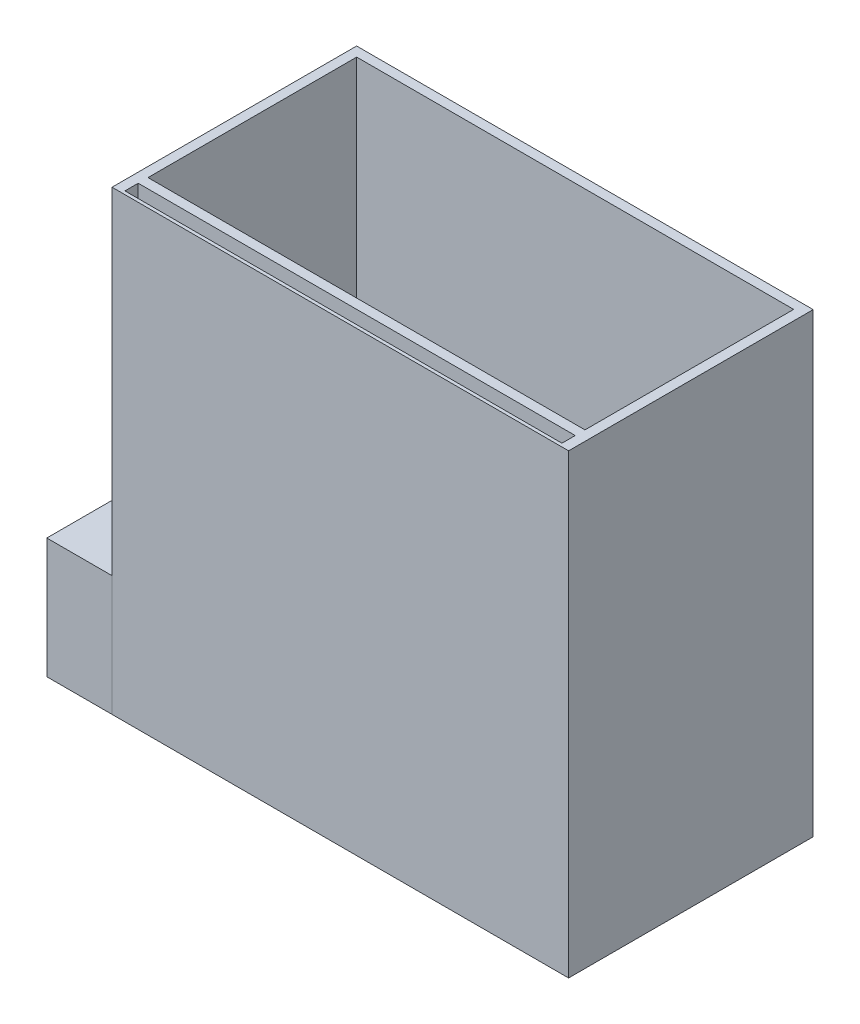
ISO-10303-21;
HEADER;
FILE_DESCRIPTION(('STEP AP214'),'2;1');
FILE_NAME('part.step','',(''),(''),'','','');
FILE_SCHEMA(('AUTOMOTIVE_DESIGN { 1 0 10303 214 1 1 1 1 }'));
ENDSEC;
DATA;
#1=APPLICATION_CONTEXT('core data for automotive mechanical design processes');
#2=APPLICATION_PROTOCOL_DEFINITION('international standard','automotive_design',2000,#1);
#3=PRODUCT_CONTEXT('',#1,'mechanical');
#4=PRODUCT('Part','Part','',(#3));
#5=PRODUCT_RELATED_PRODUCT_CATEGORY('part','',(#4));
#6=PRODUCT_DEFINITION_FORMATION('','',#4);
#7=PRODUCT_DEFINITION_CONTEXT('part definition',#1,'design');
#8=PRODUCT_DEFINITION('design','',#6,#7);
#9=PRODUCT_DEFINITION_SHAPE('','',#8);
#10=(LENGTH_UNIT() NAMED_UNIT(*) SI_UNIT(.MILLI.,.METRE.));
#11=(NAMED_UNIT(*) PLANE_ANGLE_UNIT() SI_UNIT($,.RADIAN.));
#12=(NAMED_UNIT(*) SI_UNIT($,.STERADIAN.) SOLID_ANGLE_UNIT());
#13=UNCERTAINTY_MEASURE_WITH_UNIT(LENGTH_MEASURE(1.E-05),#10,'distance_accuracy_value','');
#14=(GEOMETRIC_REPRESENTATION_CONTEXT(3) GLOBAL_UNCERTAINTY_ASSIGNED_CONTEXT((#13)) GLOBAL_UNIT_ASSIGNED_CONTEXT((#10,
#11,#12)) REPRESENTATION_CONTEXT('',''));
#15=CARTESIAN_POINT('',(0.,0.,0.));
#16=DIRECTION('',(0.,0.,1.));
#17=DIRECTION('',(1.,0.,0.));
#18=AXIS2_PLACEMENT_3D('',#15,#16,#17);
#19=CARTESIAN_POINT('',(-116.88679245283,140.,0.));
#20=DIRECTION('',(1.,0.,0.));
#21=DIRECTION('',(0.,0.,-1.));
#22=AXIS2_PLACEMENT_3D('',#19,#20,#21);
#23=PLANE('',#22);
#24=DIRECTION('',(0.,0.,-1.));
#25=VECTOR('',#24,1.);
#26=CARTESIAN_POINT('',(-116.88679245283,36.8464734911669,-58.003144654088));
#27=LINE('',#26,#25);
#28=CARTESIAN_POINT('',(-116.88679245283,36.8464734911669,16.996855345912));
#29=VERTEX_POINT('',#28);
#30=CARTESIAN_POINT('',(-116.88679245283,36.8464734911669,-58.003144654088));
#31=VERTEX_POINT('',#30);
#32=EDGE_CURVE('E11',#29,#31,#27,.T.);
#33=ORIENTED_EDGE('',*,*,#32,.F.);
#34=DIRECTION('',(0.,-1.,0.));
#35=VECTOR('',#34,1.);
#36=CARTESIAN_POINT('',(-116.88679245283,140.,16.996855345912));
#37=LINE('',#36,#35);
#38=CARTESIAN_POINT('',(-116.88679245283,140.,16.996855345912));
#39=VERTEX_POINT('',#38);
#40=EDGE_CURVE('E239',#39,#29,#37,.T.);
#41=ORIENTED_EDGE('',*,*,#40,.F.);
#42=DIRECTION('',(0.,0.,1.));
#43=VECTOR('',#42,1.);
#44=CARTESIAN_POINT('',(-116.88679245283,140.,0.));
#45=LINE('',#44,#43);
#46=CARTESIAN_POINT('',(-116.88679245283,140.,-58.003144654088));
#47=VERTEX_POINT('',#46);
#48=EDGE_CURVE('E373',#47,#39,#45,.T.);
#49=ORIENTED_EDGE('',*,*,#48,.F.);
#50=DIRECTION('',(0.,-1.,0.));
#51=VECTOR('',#50,1.);
#52=CARTESIAN_POINT('',(-116.88679245283,140.,-58.003144654088));
#53=LINE('',#52,#51);
#54=EDGE_CURVE('E375',#47,#31,#53,.T.);
#55=ORIENTED_EDGE('',*,*,#54,.T.);
#56=EDGE_LOOP('',(#33,#41,#49,#55));
#57=FACE_BOUND('',#56,.T.);
#58=ADVANCED_FACE('F41',(#57),#23,.F.);
#59=CARTESIAN_POINT('',(23.1132075471698,140.,0.));
#60=DIRECTION('',(1.,0.,0.));
#61=DIRECTION('',(0.,0.,-1.));
#62=AXIS2_PLACEMENT_3D('',#59,#60,#61);
#63=PLANE('',#62);
#64=DIRECTION('',(0.,0.,1.));
#65=VECTOR('',#64,1.);
#66=CARTESIAN_POINT('',(23.1132075471698,0.,0.));
#67=LINE('',#66,#65);
#68=CARTESIAN_POINT('',(23.1132075471698,0.,-58.003144654088));
#69=VERTEX_POINT('',#68);
#70=CARTESIAN_POINT('',(23.1132075471698,0.,16.996855345912));
#71=VERTEX_POINT('',#70);
#72=EDGE_CURVE('E360',#69,#71,#67,.T.);
#73=ORIENTED_EDGE('',*,*,#72,.F.);
#74=DIRECTION('',(0.,-1.,0.));
#75=VECTOR('',#74,1.);
#76=CARTESIAN_POINT('',(23.1132075471698,140.,-58.003144654088));
#77=LINE('',#76,#75);
#78=CARTESIAN_POINT('',(23.1132075471698,140.,-58.003144654088));
#79=VERTEX_POINT('',#78);
#80=EDGE_CURVE('E45',#79,#69,#77,.T.);
#81=ORIENTED_EDGE('',*,*,#80,.F.);
#82=DIRECTION('',(0.,0.,1.));
#83=VECTOR('',#82,1.);
#84=CARTESIAN_POINT('',(23.1132075471698,140.,0.));
#85=LINE('',#84,#83);
#86=CARTESIAN_POINT('',(23.1132075471698,140.,16.996855345912));
#87=VERTEX_POINT('',#86);
#88=EDGE_CURVE('E367',#79,#87,#85,.T.);
#89=ORIENTED_EDGE('',*,*,#88,.T.);
#90=DIRECTION('',(0.,1.,0.));
#91=VECTOR('',#90,1.);
#92=CARTESIAN_POINT('',(23.1132075471698,140.,16.996855345912));
#93=LINE('',#92,#91);
#94=EDGE_CURVE('E244',#71,#87,#93,.T.);
#95=ORIENTED_EDGE('',*,*,#94,.F.);
#96=EDGE_LOOP('',(#73,#81,#89,#95));
#97=FACE_BOUND('',#96,.T.);
#98=ADVANCED_FACE('F43',(#97),#63,.T.);
#99=CARTESIAN_POINT('',(0.,140.,-58.003144654088));
#100=DIRECTION('',(0.,0.,-1.));
#101=DIRECTION('',(-1.,0.,0.));
#102=AXIS2_PLACEMENT_3D('',#99,#100,#101);
#103=PLANE('',#102);
#104=DIRECTION('',(0.,-1.,0.));
#105=VECTOR('',#104,1.);
#106=CARTESIAN_POINT('',(-116.88679245283,27.2464734911669,-58.003144654088));
#107=LINE('',#106,#105);
#108=CARTESIAN_POINT('',(-116.88679245283,27.2464734911669,-58.003144654088));
#109=VERTEX_POINT('',#108);
#110=CARTESIAN_POINT('',(-116.88679245283,14.2464734911669,-58.003144654088));
#111=VERTEX_POINT('',#110);
#112=EDGE_CURVE('E276',#109,#111,#107,.T.);
#113=ORIENTED_EDGE('',*,*,#112,.F.);
#114=DIRECTION('',(1.,0.,0.));
#115=VECTOR('',#114,1.);
#116=CARTESIAN_POINT('',(-116.88679245283,27.2464734911669,-58.003144654088));
#117=LINE('',#116,#115);
#118=CARTESIAN_POINT('',(-122.63679245283,27.2464734911669,-58.003144654088));
#119=VERTEX_POINT('',#118);
#120=EDGE_CURVE('E287',#119,#109,#117,.T.);
#121=ORIENTED_EDGE('',*,*,#120,.F.);
#122=DIRECTION('',(0.,1.,0.));
#123=VECTOR('',#122,1.);
#124=CARTESIAN_POINT('',(-122.63679245283,27.2464734911669,-58.003144654088));
#125=LINE('',#124,#123);
#126=CARTESIAN_POINT('',(-122.63679245283,14.2464734911669,-58.003144654088));
#127=VERTEX_POINT('',#126);
#128=EDGE_CURVE('E298',#127,#119,#125,.T.);
#129=ORIENTED_EDGE('',*,*,#128,.F.);
#130=DIRECTION('',(-1.,0.,0.));
#131=VECTOR('',#130,1.);
#132=CARTESIAN_POINT('',(-116.88679245283,14.2464734911669,-58.003144654088));
#133=LINE('',#132,#131);
#134=EDGE_CURVE('E295',#111,#127,#133,.T.);
#135=ORIENTED_EDGE('',*,*,#134,.F.);
#136=EDGE_LOOP('',(#113,#121,#129,#135));
#137=FACE_BOUND('',#136,.T.);
#138=DIRECTION('',(1.,0.,0.));
#139=VECTOR('',#138,1.);
#140=CARTESIAN_POINT('',(0.,0.,-58.003144654088));
#141=LINE('',#140,#139);
#142=CARTESIAN_POINT('',(-136.88679245283,0.,-58.003144654088));
#143=VERTEX_POINT('',#142);
#144=EDGE_CURVE('E370',#143,#69,#141,.T.);
#145=ORIENTED_EDGE('',*,*,#144,.F.);
#146=DIRECTION('',(0.,-1.,0.));
#147=VECTOR('',#146,1.);
#148=CARTESIAN_POINT('',(-136.88679245283,36.8464734911669,-58.003144654088));
#149=LINE('',#148,#147);
#150=CARTESIAN_POINT('',(-136.88679245283,36.8464734911669,-58.003144654088));
#151=VERTEX_POINT('',#150);
#152=EDGE_CURVE('E312',#151,#143,#149,.T.);
#153=ORIENTED_EDGE('',*,*,#152,.F.);
#154=DIRECTION('',(1.,0.,0.));
#155=VECTOR('',#154,1.);
#156=CARTESIAN_POINT('',(-136.88679245283,36.8464734911669,-58.003144654088));
#157=LINE('',#156,#155);
#158=EDGE_CURVE('E321',#151,#31,#157,.T.);
#159=ORIENTED_EDGE('',*,*,#158,.T.);
#160=ORIENTED_EDGE('',*,*,#54,.F.);
#161=DIRECTION('',(1.,0.,0.));
#162=VECTOR('',#161,1.);
#163=CARTESIAN_POINT('',(0.,140.,-58.003144654088));
#164=LINE('',#163,#162);
#165=EDGE_CURVE('E369',#47,#79,#164,.T.);
#166=ORIENTED_EDGE('',*,*,#165,.T.);
#167=ORIENTED_EDGE('',*,*,#80,.T.);
#168=EDGE_LOOP('',(#145,#153,#159,#160,#166,#167));
#169=FACE_BOUND('',#168,.T.);
#170=ADVANCED_FACE('F381',(#137,#169),#103,.T.);
#171=CARTESIAN_POINT('',(0.,140.,0.));
#172=DIRECTION('',(0.,1.,0.));
#173=DIRECTION('',(0.,0.,1.));
#174=AXIS2_PLACEMENT_3D('',#171,#172,#173);
#175=PLANE('',#174);
#176=DIRECTION('',(0.,0.,1.));
#177=VECTOR('',#176,1.);
#178=CARTESIAN_POINT('',(-113.932929256957,140.,11.9276912054125));
#179=LINE('',#178,#177);
#180=CARTESIAN_POINT('',(-113.932929256957,140.,11.9276912054125));
#181=VERTEX_POINT('',#180);
#182=CARTESIAN_POINT('',(-113.932929256957,140.,15.9999896043341));
#183=VERTEX_POINT('',#182);
#184=EDGE_CURVE('E58',#181,#183,#179,.T.);
#185=ORIENTED_EDGE('',*,*,#184,.F.);
#186=DIRECTION('',(-1.,0.,0.));
#187=VECTOR('',#186,1.);
#188=CARTESIAN_POINT('',(20.0670707430429,140.,11.9276912054125));
#189=LINE('',#188,#187);
#190=CARTESIAN_POINT('',(20.0670707430429,140.,11.9276912054125));
#191=VERTEX_POINT('',#190);
#192=EDGE_CURVE('E220',#191,#181,#189,.T.);
#193=ORIENTED_EDGE('',*,*,#192,.F.);
#194=DIRECTION('',(0.,0.,-1.));
#195=VECTOR('',#194,1.);
#196=CARTESIAN_POINT('',(20.0670707430429,140.,11.9276912054125));
#197=LINE('',#196,#195);
#198=CARTESIAN_POINT('',(20.0670707430429,140.,15.9999896043341));
#199=VERTEX_POINT('',#198);
#200=EDGE_CURVE('E223',#199,#191,#197,.T.);
#201=ORIENTED_EDGE('',*,*,#200,.F.);
#202=DIRECTION('',(1.,0.,0.));
#203=VECTOR('',#202,1.);
#204=CARTESIAN_POINT('',(20.0670707430429,140.,15.9999896043341));
#205=LINE('',#204,#203);
#206=EDGE_CURVE('E229',#183,#199,#205,.T.);
#207=ORIENTED_EDGE('',*,*,#206,.F.);
#208=EDGE_LOOP('',(#185,#193,#201,#207));
#209=FACE_BOUND('',#208,.T.);
#210=DIRECTION('',(0.,0.,1.));
#211=VECTOR('',#210,1.);
#212=CARTESIAN_POINT('',(-113.932929256957,140.,-55.0700748409646));
#213=LINE('',#212,#211);
#214=CARTESIAN_POINT('',(-113.932929256957,140.,-55.0700748409646));
#215=VERTEX_POINT('',#214);
#216=CARTESIAN_POINT('',(-113.932929256957,140.,8.92992515903544));
#217=VERTEX_POINT('',#216);
#218=EDGE_CURVE('E334',#215,#217,#213,.T.);
#219=ORIENTED_EDGE('',*,*,#218,.F.);
#220=DIRECTION('',(-1.,0.,0.));
#221=VECTOR('',#220,1.);
#222=CARTESIAN_POINT('',(-113.932929256957,140.,-55.0700748409646));
#223=LINE('',#222,#221);
#224=CARTESIAN_POINT('',(20.0670707430429,140.,-55.0700748409646));
#225=VERTEX_POINT('',#224);
#226=EDGE_CURVE('E339',#225,#215,#223,.T.);
#227=ORIENTED_EDGE('',*,*,#226,.F.);
#228=DIRECTION('',(0.,0.,-1.));
#229=VECTOR('',#228,1.);
#230=CARTESIAN_POINT('',(20.0670707430429,140.,-55.0700748409646));
#231=LINE('',#230,#229);
#232=CARTESIAN_POINT('',(20.0670707430429,140.,8.92992515903544));
#233=VERTEX_POINT('',#232);
#234=EDGE_CURVE('E353',#233,#225,#231,.T.);
#235=ORIENTED_EDGE('',*,*,#234,.F.);
#236=DIRECTION('',(1.,0.,0.));
#237=VECTOR('',#236,1.);
#238=CARTESIAN_POINT('',(-113.932929256957,140.,8.92992515903544));
#239=LINE('',#238,#237);
#240=EDGE_CURVE('E350',#217,#233,#239,.T.);
#241=ORIENTED_EDGE('',*,*,#240,.F.);
#242=EDGE_LOOP('',(#219,#227,#235,#241));
#243=FACE_BOUND('',#242,.T.);
#244=ORIENTED_EDGE('',*,*,#88,.F.);
#245=ORIENTED_EDGE('',*,*,#165,.F.);
#246=ORIENTED_EDGE('',*,*,#48,.T.);
#247=DIRECTION('',(-1.,0.,0.));
#248=VECTOR('',#247,1.);
#249=CARTESIAN_POINT('',(-116.88679245283,140.,16.996855345912));
#250=LINE('',#249,#248);
#251=EDGE_CURVE('E247',#87,#39,#250,.T.);
#252=ORIENTED_EDGE('',*,*,#251,.F.);
#253=EDGE_LOOP('',(#244,#245,#246,#252));
#254=FACE_BOUND('',#253,.T.);
#255=ADVANCED_FACE('F429',(#209,#243,#254),#175,.T.);
#256=CARTESIAN_POINT('',(0.,0.,0.));
#257=DIRECTION('',(0.,1.,0.));
#258=DIRECTION('',(0.,0.,1.));
#259=AXIS2_PLACEMENT_3D('',#256,#257,#258);
#260=PLANE('',#259);
#261=ORIENTED_EDGE('',*,*,#72,.T.);
#262=DIRECTION('',(1.,0.,0.));
#263=VECTOR('',#262,1.);
#264=CARTESIAN_POINT('',(-116.88679245283,0.,16.996855345912));
#265=LINE('',#264,#263);
#266=CARTESIAN_POINT('',(-116.88679245283,0.,16.996855345912));
#267=VERTEX_POINT('',#266);
#268=EDGE_CURVE('E241',#267,#71,#265,.T.);
#269=ORIENTED_EDGE('',*,*,#268,.F.);
#270=DIRECTION('',(0.,0.,1.));
#271=VECTOR('',#270,1.);
#272=CARTESIAN_POINT('',(-116.88679245283,0.,-58.003144654088));
#273=LINE('',#272,#271);
#274=CARTESIAN_POINT('',(-116.88679245283,0.,16.9971158488808));
#275=VERTEX_POINT('',#274);
#276=EDGE_CURVE('E305',#267,#275,#273,.T.);
#277=ORIENTED_EDGE('',*,*,#276,.T.);
#278=DIRECTION('',(1.,0.,0.));
#279=VECTOR('',#278,1.);
#280=CARTESIAN_POINT('',(-136.88679245283,0.,16.9971158488808));
#281=LINE('',#280,#279);
#282=CARTESIAN_POINT('',(-136.88679245283,0.,16.9971158488808));
#283=VERTEX_POINT('',#282);
#284=EDGE_CURVE('E331',#283,#275,#281,.T.);
#285=ORIENTED_EDGE('',*,*,#284,.F.);
#286=DIRECTION('',(0.,0.,1.));
#287=VECTOR('',#286,1.);
#288=CARTESIAN_POINT('',(-136.88679245283,0.,-58.003144654088));
#289=LINE('',#288,#287);
#290=EDGE_CURVE('E315',#143,#283,#289,.T.);
#291=ORIENTED_EDGE('',*,*,#290,.F.);
#292=ORIENTED_EDGE('',*,*,#144,.T.);
#293=EDGE_LOOP('',(#261,#269,#277,#285,#291,#292));
#294=FACE_BOUND('',#293,.T.);
#295=ADVANCED_FACE('F390',(#294),#260,.F.);
#296=CARTESIAN_POINT('',(-113.932929256957,7.00000000000001,-55.0700748409646));
#297=DIRECTION('',(-1.,0.,0.));
#298=DIRECTION('',(0.,0.,1.));
#299=AXIS2_PLACEMENT_3D('',#296,#297,#298);
#300=PLANE('',#299);
#301=ORIENTED_EDGE('',*,*,#218,.T.);
#302=DIRECTION('',(0.,1.,0.));
#303=VECTOR('',#302,1.);
#304=CARTESIAN_POINT('',(-113.932929256957,7.00000000000001,8.92992515903544));
#305=LINE('',#304,#303);
#306=CARTESIAN_POINT('',(-113.932929256957,7.00000000000001,8.92992515903544));
#307=VERTEX_POINT('',#306);
#308=EDGE_CURVE('E348',#307,#217,#305,.T.);
#309=ORIENTED_EDGE('',*,*,#308,.F.);
#310=DIRECTION('',(0.,0.,1.));
#311=VECTOR('',#310,1.);
#312=CARTESIAN_POINT('',(-113.932929256957,7.00000000000001,-55.0700748409646));
#313=LINE('',#312,#311);
#314=CARTESIAN_POINT('',(-113.932929256957,7.00000000000001,-55.0700748409646));
#315=VERTEX_POINT('',#314);
#316=EDGE_CURVE('E335',#315,#307,#313,.T.);
#317=ORIENTED_EDGE('',*,*,#316,.F.);
#318=DIRECTION('',(0.,1.,0.));
#319=VECTOR('',#318,1.);
#320=CARTESIAN_POINT('',(-113.932929256957,7.00000000000001,-55.0700748409646));
#321=LINE('',#320,#319);
#322=EDGE_CURVE('E358',#315,#215,#321,.T.);
#323=ORIENTED_EDGE('',*,*,#322,.T.);
#324=EDGE_LOOP('',(#301,#309,#317,#323));
#325=FACE_BOUND('',#324,.T.);
#326=ADVANCED_FACE('F543',(#325),#300,.F.);
#327=CARTESIAN_POINT('',(-113.932929256957,7.00000000000001,-55.0700748409646));
#328=DIRECTION('',(0.,0.,-1.));
#329=DIRECTION('',(-1.,0.,0.));
#330=AXIS2_PLACEMENT_3D('',#327,#328,#329);
#331=PLANE('',#330);
#332=ORIENTED_EDGE('',*,*,#226,.T.);
#333=ORIENTED_EDGE('',*,*,#322,.F.);
#334=DIRECTION('',(-1.,0.,0.));
#335=VECTOR('',#334,1.);
#336=CARTESIAN_POINT('',(-113.932929256957,7.00000000000001,-55.0700748409646));
#337=LINE('',#336,#335);
#338=CARTESIAN_POINT('',(20.0670707430429,7.00000000000001,-55.0700748409646));
#339=VERTEX_POINT('',#338);
#340=EDGE_CURVE('E345',#339,#315,#337,.T.);
#341=ORIENTED_EDGE('',*,*,#340,.F.);
#342=DIRECTION('',(0.,1.,0.));
#343=VECTOR('',#342,1.);
#344=CARTESIAN_POINT('',(20.0670707430429,7.00000000000001,-55.0700748409646));
#345=LINE('',#344,#343);
#346=EDGE_CURVE('E361',#339,#225,#345,.T.);
#347=ORIENTED_EDGE('',*,*,#346,.T.);
#348=EDGE_LOOP('',(#332,#333,#341,#347));
#349=FACE_BOUND('',#348,.T.);
#350=ADVANCED_FACE('F591',(#349),#331,.F.);
#351=CARTESIAN_POINT('',(20.0670707430429,7.00000000000001,-55.0700748409646));
#352=DIRECTION('',(1.,0.,0.));
#353=DIRECTION('',(0.,0.,-1.));
#354=AXIS2_PLACEMENT_3D('',#351,#352,#353);
#355=PLANE('',#354);
#356=ORIENTED_EDGE('',*,*,#234,.T.);
#357=ORIENTED_EDGE('',*,*,#346,.F.);
#358=DIRECTION('',(0.,0.,-1.));
#359=VECTOR('',#358,1.);
#360=CARTESIAN_POINT('',(20.0670707430429,7.00000000000001,-55.0700748409646));
#361=LINE('',#360,#359);
#362=CARTESIAN_POINT('',(20.0670707430429,7.00000000000001,8.92992515903544));
#363=VERTEX_POINT('',#362);
#364=EDGE_CURVE('E342',#363,#339,#361,.T.);
#365=ORIENTED_EDGE('',*,*,#364,.F.);
#366=DIRECTION('',(0.,1.,0.));
#367=VECTOR('',#366,1.);
#368=CARTESIAN_POINT('',(20.0670707430429,7.00000000000001,8.92992515903544));
#369=LINE('',#368,#367);
#370=EDGE_CURVE('E363',#363,#233,#369,.T.);
#371=ORIENTED_EDGE('',*,*,#370,.T.);
#372=EDGE_LOOP('',(#356,#357,#365,#371));
#373=FACE_BOUND('',#372,.T.);
#374=ADVANCED_FACE('F600',(#373),#355,.F.);
#375=CARTESIAN_POINT('',(-113.932929256957,7.00000000000001,8.92992515903544));
#376=DIRECTION('',(0.,0.,1.));
#377=DIRECTION('',(1.,0.,0.));
#378=AXIS2_PLACEMENT_3D('',#375,#376,#377);
#379=PLANE('',#378);
#380=ORIENTED_EDGE('',*,*,#240,.T.);
#381=ORIENTED_EDGE('',*,*,#370,.F.);
#382=DIRECTION('',(1.,0.,0.));
#383=VECTOR('',#382,1.);
#384=CARTESIAN_POINT('',(-113.932929256957,7.00000000000001,8.92992515903544));
#385=LINE('',#384,#383);
#386=EDGE_CURVE('E338',#307,#363,#385,.T.);
#387=ORIENTED_EDGE('',*,*,#386,.F.);
#388=ORIENTED_EDGE('',*,*,#308,.T.);
#389=EDGE_LOOP('',(#380,#381,#387,#388));
#390=FACE_BOUND('',#389,.T.);
#391=ADVANCED_FACE('F418',(#390),#379,.F.);
#392=CARTESIAN_POINT('',(0.,7.00000000000001,0.));
#393=DIRECTION('',(0.,1.,0.));
#394=DIRECTION('',(0.,0.,1.));
#395=AXIS2_PLACEMENT_3D('',#392,#393,#394);
#396=PLANE('',#395);
#397=ORIENTED_EDGE('',*,*,#316,.T.);
#398=ORIENTED_EDGE('',*,*,#386,.T.);
#399=ORIENTED_EDGE('',*,*,#364,.T.);
#400=ORIENTED_EDGE('',*,*,#340,.T.);
#401=EDGE_LOOP('',(#397,#398,#399,#400));
#402=FACE_BOUND('',#401,.T.);
#403=ADVANCED_FACE('F411',(#402),#396,.T.);
#404=CARTESIAN_POINT('',(-136.88679245283,36.8464734911669,16.9971158488808));
#405=DIRECTION('',(0.,0.,-1.));
#406=DIRECTION('',(-1.,0.,0.));
#407=AXIS2_PLACEMENT_3D('',#404,#405,#406);
#408=PLANE('',#407);
#409=DIRECTION('',(0.,1.,0.));
#410=VECTOR('',#409,1.);
#411=CARTESIAN_POINT('',(-116.88679245283,36.8464734911669,16.9971158488808));
#412=LINE('',#411,#410);
#413=CARTESIAN_POINT('',(-116.88679245283,36.8464734911669,16.9971158488808));
#414=VERTEX_POINT('',#413);
#415=EDGE_CURVE('E323',#275,#414,#412,.T.);
#416=ORIENTED_EDGE('',*,*,#415,.T.);
#417=DIRECTION('',(1.,0.,0.));
#418=VECTOR('',#417,1.);
#419=CARTESIAN_POINT('',(-136.88679245283,36.8464734911669,16.9971158488808));
#420=LINE('',#419,#418);
#421=CARTESIAN_POINT('',(-136.88679245283,36.8464734911669,16.9971158488808));
#422=VERTEX_POINT('',#421);
#423=EDGE_CURVE('E328',#422,#414,#420,.T.);
#424=ORIENTED_EDGE('',*,*,#423,.F.);
#425=DIRECTION('',(0.,1.,0.));
#426=VECTOR('',#425,1.);
#427=CARTESIAN_POINT('',(-136.88679245283,36.8464734911669,16.9971158488808));
#428=LINE('',#427,#426);
#429=EDGE_CURVE('E317',#283,#422,#428,.T.);
#430=ORIENTED_EDGE('',*,*,#429,.F.);
#431=ORIENTED_EDGE('',*,*,#284,.T.);
#432=EDGE_LOOP('',(#416,#424,#430,#431));
#433=FACE_BOUND('',#432,.T.);
#434=ADVANCED_FACE('F409',(#433),#408,.F.);
#435=CARTESIAN_POINT('',(-136.88679245283,36.8464734911669,-58.003144654088));
#436=DIRECTION('',(0.,-1.,0.));
#437=DIRECTION('',(0.,0.,-1.));
#438=AXIS2_PLACEMENT_3D('',#435,#436,#437);
#439=PLANE('',#438);
#440=EDGE_CURVE('E51',#414,#29,#27,.T.);
#441=ORIENTED_EDGE('',*,*,#440,.T.);
#442=ORIENTED_EDGE('',*,*,#32,.T.);
#443=ORIENTED_EDGE('',*,*,#158,.F.);
#444=DIRECTION('',(0.,0.,-1.));
#445=VECTOR('',#444,1.);
#446=CARTESIAN_POINT('',(-136.88679245283,36.8464734911669,-58.003144654088));
#447=LINE('',#446,#445);
#448=EDGE_CURVE('E319',#422,#151,#447,.T.);
#449=ORIENTED_EDGE('',*,*,#448,.F.);
#450=ORIENTED_EDGE('',*,*,#423,.T.);
#451=EDGE_LOOP('',(#441,#442,#443,#449,#450));
#452=FACE_BOUND('',#451,.T.);
#453=ADVANCED_FACE('F398',(#452),#439,.F.);
#454=CARTESIAN_POINT('',(-136.88679245283,0.,0.));
#455=DIRECTION('',(-1.,0.,0.));
#456=DIRECTION('',(0.,0.,1.));
#457=AXIS2_PLACEMENT_3D('',#454,#455,#456);
#458=PLANE('',#457);
#459=ORIENTED_EDGE('',*,*,#152,.T.);
#460=ORIENTED_EDGE('',*,*,#290,.T.);
#461=ORIENTED_EDGE('',*,*,#429,.T.);
#462=ORIENTED_EDGE('',*,*,#448,.T.);
#463=EDGE_LOOP('',(#459,#460,#461,#462));
#464=FACE_BOUND('',#463,.T.);
#465=ADVANCED_FACE('F394',(#464),#458,.T.);
#466=CARTESIAN_POINT('',(-116.88679245283,0.,0.));
#467=DIRECTION('',(-1.,0.,0.));
#468=DIRECTION('',(0.,0.,1.));
#469=AXIS2_PLACEMENT_3D('',#466,#467,#468);
#470=PLANE('',#469);
#471=ORIENTED_EDGE('',*,*,#276,.F.);
#472=EDGE_CURVE('E235',#29,#267,#37,.T.);
#473=ORIENTED_EDGE('',*,*,#472,.F.);
#474=ORIENTED_EDGE('',*,*,#440,.F.);
#475=ORIENTED_EDGE('',*,*,#415,.F.);
#476=EDGE_LOOP('',(#471,#473,#474,#475));
#477=FACE_BOUND('',#476,.T.);
#478=ADVANCED_FACE('F405',(#477),#470,.F.);
#479=CARTESIAN_POINT('',(-116.88679245283,27.2464734911669,-55.003144654088));
#480=DIRECTION('',(1.,0.,0.));
#481=DIRECTION('',(0.,0.,-1.));
#482=AXIS2_PLACEMENT_3D('',#479,#480,#481);
#483=PLANE('',#482);
#484=ORIENTED_EDGE('',*,*,#112,.T.);
#485=DIRECTION('',(0.,0.,-1.));
#486=VECTOR('',#485,1.);
#487=CARTESIAN_POINT('',(-116.88679245283,14.2464734911669,-55.003144654088));
#488=LINE('',#487,#486);
#489=CARTESIAN_POINT('',(-116.88679245283,14.2464734911669,-55.003144654088));
#490=VERTEX_POINT('',#489);
#491=EDGE_CURVE('E293',#490,#111,#488,.T.);
#492=ORIENTED_EDGE('',*,*,#491,.F.);
#493=DIRECTION('',(0.,-1.,0.));
#494=VECTOR('',#493,1.);
#495=CARTESIAN_POINT('',(-116.88679245283,27.2464734911669,-55.003144654088));
#496=LINE('',#495,#494);
#497=CARTESIAN_POINT('',(-116.88679245283,27.2464734911669,-55.003144654088));
#498=VERTEX_POINT('',#497);
#499=EDGE_CURVE('E284',#498,#490,#496,.T.);
#500=ORIENTED_EDGE('',*,*,#499,.F.);
#501=DIRECTION('',(0.,0.,-1.));
#502=VECTOR('',#501,1.);
#503=CARTESIAN_POINT('',(-116.88679245283,27.2464734911669,-55.003144654088));
#504=LINE('',#503,#502);
#505=EDGE_CURVE('E303',#498,#109,#504,.T.);
#506=ORIENTED_EDGE('',*,*,#505,.T.);
#507=EDGE_LOOP('',(#484,#492,#500,#506));
#508=FACE_BOUND('',#507,.T.);
#509=ADVANCED_FACE('F441',(#508),#483,.F.);
#510=CARTESIAN_POINT('',(-116.88679245283,27.2464734911669,-55.003144654088));
#511=DIRECTION('',(0.,1.,0.));
#512=DIRECTION('',(0.,0.,1.));
#513=AXIS2_PLACEMENT_3D('',#510,#511,#512);
#514=PLANE('',#513);
#515=ORIENTED_EDGE('',*,*,#120,.T.);
#516=ORIENTED_EDGE('',*,*,#505,.F.);
#517=DIRECTION('',(1.,0.,0.));
#518=VECTOR('',#517,1.);
#519=CARTESIAN_POINT('',(-116.88679245283,27.2464734911669,-55.003144654088));
#520=LINE('',#519,#518);
#521=CARTESIAN_POINT('',(-122.63679245283,27.2464734911669,-55.003144654088));
#522=VERTEX_POINT('',#521);
#523=EDGE_CURVE('E291',#522,#498,#520,.T.);
#524=ORIENTED_EDGE('',*,*,#523,.F.);
#525=DIRECTION('',(0.,0.,-1.));
#526=VECTOR('',#525,1.);
#527=CARTESIAN_POINT('',(-122.63679245283,27.2464734911669,-55.003144654088));
#528=LINE('',#527,#526);
#529=EDGE_CURVE('E306',#522,#119,#528,.T.);
#530=ORIENTED_EDGE('',*,*,#529,.T.);
#531=EDGE_LOOP('',(#515,#516,#524,#530));
#532=FACE_BOUND('',#531,.T.);
#533=ADVANCED_FACE('F454',(#532),#514,.F.);
#534=CARTESIAN_POINT('',(-122.63679245283,27.2464734911669,-55.003144654088));
#535=DIRECTION('',(-1.,0.,0.));
#536=DIRECTION('',(0.,0.,1.));
#537=AXIS2_PLACEMENT_3D('',#534,#535,#536);
#538=PLANE('',#537);
#539=ORIENTED_EDGE('',*,*,#128,.T.);
#540=ORIENTED_EDGE('',*,*,#529,.F.);
#541=DIRECTION('',(0.,1.,0.));
#542=VECTOR('',#541,1.);
#543=CARTESIAN_POINT('',(-122.63679245283,27.2464734911669,-55.003144654088));
#544=LINE('',#543,#542);
#545=CARTESIAN_POINT('',(-122.63679245283,14.2464734911669,-55.003144654088));
#546=VERTEX_POINT('',#545);
#547=EDGE_CURVE('E289',#546,#522,#544,.T.);
#548=ORIENTED_EDGE('',*,*,#547,.F.);
#549=DIRECTION('',(0.,0.,-1.));
#550=VECTOR('',#549,1.);
#551=CARTESIAN_POINT('',(-122.63679245283,14.2464734911669,-55.003144654088));
#552=LINE('',#551,#550);
#553=EDGE_CURVE('E308',#546,#127,#552,.T.);
#554=ORIENTED_EDGE('',*,*,#553,.T.);
#555=EDGE_LOOP('',(#539,#540,#548,#554));
#556=FACE_BOUND('',#555,.T.);
#557=ADVANCED_FACE('F456',(#556),#538,.F.);
#558=CARTESIAN_POINT('',(-116.88679245283,14.2464734911669,-55.003144654088));
#559=DIRECTION('',(0.,-1.,0.));
#560=DIRECTION('',(0.,0.,-1.));
#561=AXIS2_PLACEMENT_3D('',#558,#559,#560);
#562=PLANE('',#561);
#563=ORIENTED_EDGE('',*,*,#134,.T.);
#564=ORIENTED_EDGE('',*,*,#553,.F.);
#565=DIRECTION('',(-1.,0.,0.));
#566=VECTOR('',#565,1.);
#567=CARTESIAN_POINT('',(-116.88679245283,14.2464734911669,-55.003144654088));
#568=LINE('',#567,#566);
#569=EDGE_CURVE('E286',#490,#546,#568,.T.);
#570=ORIENTED_EDGE('',*,*,#569,.F.);
#571=ORIENTED_EDGE('',*,*,#491,.T.);
#572=EDGE_LOOP('',(#563,#564,#570,#571));
#573=FACE_BOUND('',#572,.T.);
#574=ADVANCED_FACE('F446',(#573),#562,.F.);
#575=CARTESIAN_POINT('',(0.,0.,11.996855345912));
#576=DIRECTION('',(0.,0.,1.));
#577=DIRECTION('',(1.,0.,0.));
#578=AXIS2_PLACEMENT_3D('',#575,#576,#577);
#579=PLANE('',#578);
#580=DIRECTION('',(1.,0.,0.));
#581=VECTOR('',#580,1.);
#582=CARTESIAN_POINT('',(-133.88238983569,2.99647349116687,11.996855345912));
#583=LINE('',#582,#581);
#584=CARTESIAN_POINT('',(-133.88238983569,2.99647349116687,11.996855345912));
#585=VERTEX_POINT('',#584);
#586=CARTESIAN_POINT('',(-116.88238983569,2.99647349116687,11.996855345912));
#587=VERTEX_POINT('',#586);
#588=EDGE_CURVE('E267',#585,#587,#583,.T.);
#589=ORIENTED_EDGE('',*,*,#588,.F.);
#590=DIRECTION('',(0.,-1.,0.));
#591=VECTOR('',#590,1.);
#592=CARTESIAN_POINT('',(-133.88238983569,33.8464734911669,11.996855345912));
#593=LINE('',#592,#591);
#594=CARTESIAN_POINT('',(-133.88238983569,33.8464734911669,11.996855345912));
#595=VERTEX_POINT('',#594);
#596=EDGE_CURVE('E250',#595,#585,#593,.T.);
#597=ORIENTED_EDGE('',*,*,#596,.F.);
#598=DIRECTION('',(-1.,0.,0.));
#599=VECTOR('',#598,1.);
#600=CARTESIAN_POINT('',(-133.88238983569,33.8464734911669,11.996855345912));
#601=LINE('',#600,#599);
#602=CARTESIAN_POINT('',(-116.88238983569,33.8464734911669,11.996855345912));
#603=VERTEX_POINT('',#602);
#604=EDGE_CURVE('E255',#603,#595,#601,.T.);
#605=ORIENTED_EDGE('',*,*,#604,.F.);
#606=DIRECTION('',(0.,1.,0.));
#607=VECTOR('',#606,1.);
#608=CARTESIAN_POINT('',(-116.88238983569,33.8464734911669,11.996855345912));
#609=LINE('',#608,#607);
#610=EDGE_CURVE('E269',#587,#603,#609,.T.);
#611=ORIENTED_EDGE('',*,*,#610,.F.);
#612=EDGE_LOOP('',(#589,#597,#605,#611));
#613=FACE_BOUND('',#612,.T.);
#614=ADVANCED_FACE('F463',(#613),#579,.F.);
#615=CARTESIAN_POINT('',(0.,0.,-55.003144654088));
#616=DIRECTION('',(0.,0.,1.));
#617=DIRECTION('',(1.,0.,0.));
#618=AXIS2_PLACEMENT_3D('',#615,#616,#617);
#619=PLANE('',#618);
#620=DIRECTION('',(0.,-1.,0.));
#621=VECTOR('',#620,1.);
#622=CARTESIAN_POINT('',(-133.88238983569,33.8464734911669,-55.003144654088));
#623=LINE('',#622,#621);
#624=CARTESIAN_POINT('',(-133.88238983569,33.8464734911669,-55.003144654088));
#625=VERTEX_POINT('',#624);
#626=CARTESIAN_POINT('',(-133.88238983569,2.99647349116687,-55.003144654088));
#627=VERTEX_POINT('',#626);
#628=EDGE_CURVE('E251',#625,#627,#623,.T.);
#629=ORIENTED_EDGE('',*,*,#628,.T.);
#630=DIRECTION('',(1.,0.,0.));
#631=VECTOR('',#630,1.);
#632=CARTESIAN_POINT('',(-133.88238983569,2.99647349116687,-55.003144654088));
#633=LINE('',#632,#631);
#634=CARTESIAN_POINT('',(-116.88238983569,2.99647349116687,-55.003144654088));
#635=VERTEX_POINT('',#634);
#636=EDGE_CURVE('E254',#627,#635,#633,.T.);
#637=ORIENTED_EDGE('',*,*,#636,.T.);
#638=DIRECTION('',(0.,1.,0.));
#639=VECTOR('',#638,1.);
#640=CARTESIAN_POINT('',(-116.88238983569,33.8464734911669,-55.003144654088));
#641=LINE('',#640,#639);
#642=CARTESIAN_POINT('',(-116.88238983569,33.8464734911669,-55.003144654088));
#643=VERTEX_POINT('',#642);
#644=EDGE_CURVE('E258',#635,#643,#641,.T.);
#645=ORIENTED_EDGE('',*,*,#644,.T.);
#646=DIRECTION('',(-1.,0.,0.));
#647=VECTOR('',#646,1.);
#648=CARTESIAN_POINT('',(-133.88238983569,33.8464734911669,-55.003144654088));
#649=LINE('',#648,#647);
#650=EDGE_CURVE('E261',#643,#625,#649,.T.);
#651=ORIENTED_EDGE('',*,*,#650,.T.);
#652=EDGE_LOOP('',(#629,#637,#645,#651));
#653=FACE_BOUND('',#652,.T.);
#654=ORIENTED_EDGE('',*,*,#499,.T.);
#655=ORIENTED_EDGE('',*,*,#569,.T.);
#656=ORIENTED_EDGE('',*,*,#547,.T.);
#657=ORIENTED_EDGE('',*,*,#523,.T.);
#658=EDGE_LOOP('',(#654,#655,#656,#657));
#659=FACE_BOUND('',#658,.T.);
#660=ADVANCED_FACE('F450',(#653,#659),#619,.T.);
#661=CARTESIAN_POINT('',(-133.88238983569,33.8464734911669,-55.003144654088));
#662=DIRECTION('',(-1.,0.,0.));
#663=DIRECTION('',(0.,0.,1.));
#664=AXIS2_PLACEMENT_3D('',#661,#662,#663);
#665=PLANE('',#664);
#666=ORIENTED_EDGE('',*,*,#596,.T.);
#667=DIRECTION('',(0.,0.,1.));
#668=VECTOR('',#667,1.);
#669=CARTESIAN_POINT('',(-133.88238983569,2.99647349116687,-55.003144654088));
#670=LINE('',#669,#668);
#671=EDGE_CURVE('E264',#627,#585,#670,.T.);
#672=ORIENTED_EDGE('',*,*,#671,.F.);
#673=ORIENTED_EDGE('',*,*,#628,.F.);
#674=DIRECTION('',(0.,0.,1.));
#675=VECTOR('',#674,1.);
#676=CARTESIAN_POINT('',(-133.88238983569,33.8464734911669,-55.003144654088));
#677=LINE('',#676,#675);
#678=EDGE_CURVE('E273',#625,#595,#677,.T.);
#679=ORIENTED_EDGE('',*,*,#678,.T.);
#680=EDGE_LOOP('',(#666,#672,#673,#679));
#681=FACE_BOUND('',#680,.T.);
#682=ADVANCED_FACE('F508',(#681),#665,.F.);
#683=CARTESIAN_POINT('',(-133.88238983569,33.8464734911669,-55.003144654088));
#684=DIRECTION('',(0.,1.,0.));
#685=DIRECTION('',(0.,0.,1.));
#686=AXIS2_PLACEMENT_3D('',#683,#684,#685);
#687=PLANE('',#686);
#688=DIRECTION('',(0.,0.,1.));
#689=VECTOR('',#688,1.);
#690=CARTESIAN_POINT('',(-116.88238983569,33.8464734911669,-55.003144654088));
#691=LINE('',#690,#689);
#692=EDGE_CURVE('E277',#643,#603,#691,.T.);
#693=ORIENTED_EDGE('',*,*,#692,.T.);
#694=ORIENTED_EDGE('',*,*,#604,.T.);
#695=ORIENTED_EDGE('',*,*,#678,.F.);
#696=ORIENTED_EDGE('',*,*,#650,.F.);
#697=EDGE_LOOP('',(#693,#694,#695,#696));
#698=FACE_BOUND('',#697,.T.);
#699=ADVANCED_FACE('F517',(#698),#687,.F.);
#700=CARTESIAN_POINT('',(-116.88238983569,33.8464734911669,-55.003144654088));
#701=DIRECTION('',(1.,0.,0.));
#702=DIRECTION('',(0.,0.,-1.));
#703=AXIS2_PLACEMENT_3D('',#700,#701,#702);
#704=PLANE('',#703);
#705=ORIENTED_EDGE('',*,*,#610,.T.);
#706=ORIENTED_EDGE('',*,*,#692,.F.);
#707=ORIENTED_EDGE('',*,*,#644,.F.);
#708=DIRECTION('',(0.,0.,1.));
#709=VECTOR('',#708,1.);
#710=CARTESIAN_POINT('',(-116.88238983569,2.99647349116687,-55.003144654088));
#711=LINE('',#710,#709);
#712=EDGE_CURVE('E280',#635,#587,#711,.T.);
#713=ORIENTED_EDGE('',*,*,#712,.T.);
#714=EDGE_LOOP('',(#705,#706,#707,#713));
#715=FACE_BOUND('',#714,.T.);
#716=ADVANCED_FACE('F698',(#715),#704,.F.);
#717=CARTESIAN_POINT('',(-133.88238983569,2.99647349116687,-55.003144654088));
#718=DIRECTION('',(0.,-1.,0.));
#719=DIRECTION('',(0.,0.,-1.));
#720=AXIS2_PLACEMENT_3D('',#717,#718,#719);
#721=PLANE('',#720);
#722=ORIENTED_EDGE('',*,*,#588,.T.);
#723=ORIENTED_EDGE('',*,*,#712,.F.);
#724=ORIENTED_EDGE('',*,*,#636,.F.);
#725=ORIENTED_EDGE('',*,*,#671,.T.);
#726=EDGE_LOOP('',(#722,#723,#724,#725));
#727=FACE_BOUND('',#726,.T.);
#728=ADVANCED_FACE('F693',(#727),#721,.F.);
#729=CARTESIAN_POINT('',(0.,0.,16.996855345912));
#730=DIRECTION('',(0.,0.,1.));
#731=DIRECTION('',(1.,0.,0.));
#732=AXIS2_PLACEMENT_3D('',#729,#730,#731);
#733=PLANE('',#732);
#734=ORIENTED_EDGE('',*,*,#40,.T.);
#735=ORIENTED_EDGE('',*,*,#472,.T.);
#736=ORIENTED_EDGE('',*,*,#268,.T.);
#737=ORIENTED_EDGE('',*,*,#94,.T.);
#738=ORIENTED_EDGE('',*,*,#251,.T.);
#739=EDGE_LOOP('',(#734,#735,#736,#737,#738));
#740=FACE_BOUND('',#739,.T.);
#741=ADVANCED_FACE('F407',(#740),#733,.T.);
#742=CARTESIAN_POINT('',(-113.932929256957,3.,11.9276912054125));
#743=DIRECTION('',(-1.,0.,0.));
#744=DIRECTION('',(0.,0.,1.));
#745=AXIS2_PLACEMENT_3D('',#742,#743,#744);
#746=PLANE('',#745);
#747=ORIENTED_EDGE('',*,*,#184,.T.);
#748=DIRECTION('',(0.,1.,0.));
#749=VECTOR('',#748,1.);
#750=CARTESIAN_POINT('',(-113.932929256957,3.,15.9999896043341));
#751=LINE('',#750,#749);
#752=CARTESIAN_POINT('',(-113.932929256957,3.,15.9999896043341));
#753=VERTEX_POINT('',#752);
#754=EDGE_CURVE('E198',#753,#183,#751,.T.);
#755=ORIENTED_EDGE('',*,*,#754,.F.);
#756=DIRECTION('',(0.,0.,1.));
#757=VECTOR('',#756,1.);
#758=CARTESIAN_POINT('',(-113.932929256957,3.,11.9276912054125));
#759=LINE('',#758,#757);
#760=CARTESIAN_POINT('',(-113.932929256957,3.,11.9276912054125));
#761=VERTEX_POINT('',#760);
#762=EDGE_CURVE('E202',#761,#753,#759,.T.);
#763=ORIENTED_EDGE('',*,*,#762,.F.);
#764=DIRECTION('',(0.,1.,0.));
#765=VECTOR('',#764,1.);
#766=CARTESIAN_POINT('',(-113.932929256957,3.,11.9276912054125));
#767=LINE('',#766,#765);
#768=EDGE_CURVE('E233',#761,#181,#767,.T.);
#769=ORIENTED_EDGE('',*,*,#768,.T.);
#770=EDGE_LOOP('',(#747,#755,#763,#769));
#771=FACE_BOUND('',#770,.T.);
#772=ADVANCED_FACE('F200',(#771),#746,.F.);
#773=CARTESIAN_POINT('',(20.0670707430429,3.,11.9276912054125));
#774=DIRECTION('',(0.,0.,-1.));
#775=DIRECTION('',(-1.,0.,0.));
#776=AXIS2_PLACEMENT_3D('',#773,#774,#775);
#777=PLANE('',#776);
#778=ORIENTED_EDGE('',*,*,#192,.T.);
#779=ORIENTED_EDGE('',*,*,#768,.F.);
#780=DIRECTION('',(-1.,0.,0.));
#781=VECTOR('',#780,1.);
#782=CARTESIAN_POINT('',(20.0670707430429,3.,11.9276912054125));
#783=LINE('',#782,#781);
#784=CARTESIAN_POINT('',(20.0670707430429,3.,11.9276912054125));
#785=VERTEX_POINT('',#784);
#786=EDGE_CURVE('E208',#785,#761,#783,.T.);
#787=ORIENTED_EDGE('',*,*,#786,.F.);
#788=DIRECTION('',(0.,1.,0.));
#789=VECTOR('',#788,1.);
#790=CARTESIAN_POINT('',(20.0670707430429,3.,11.9276912054125));
#791=LINE('',#790,#789);
#792=EDGE_CURVE('E236',#785,#191,#791,.T.);
#793=ORIENTED_EDGE('',*,*,#792,.T.);
#794=EDGE_LOOP('',(#778,#779,#787,#793));
#795=FACE_BOUND('',#794,.T.);
#796=ADVANCED_FACE('F652',(#795),#777,.F.);
#797=CARTESIAN_POINT('',(20.0670707430429,3.,11.9276912054125));
#798=DIRECTION('',(1.,0.,0.));
#799=DIRECTION('',(0.,0.,-1.));
#800=AXIS2_PLACEMENT_3D('',#797,#798,#799);
#801=PLANE('',#800);
#802=ORIENTED_EDGE('',*,*,#200,.T.);
#803=ORIENTED_EDGE('',*,*,#792,.F.);
#804=DIRECTION('',(0.,0.,-1.));
#805=VECTOR('',#804,1.);
#806=CARTESIAN_POINT('',(20.0670707430429,3.,11.9276912054125));
#807=LINE('',#806,#805);
#808=CARTESIAN_POINT('',(20.0670707430429,3.,15.9999896043341));
#809=VERTEX_POINT('',#808);
#810=EDGE_CURVE('E216',#809,#785,#807,.T.);
#811=ORIENTED_EDGE('',*,*,#810,.F.);
#812=DIRECTION('',(0.,1.,0.));
#813=VECTOR('',#812,1.);
#814=CARTESIAN_POINT('',(20.0670707430429,3.,15.9999896043341));
#815=LINE('',#814,#813);
#816=EDGE_CURVE('E207',#809,#199,#815,.T.);
#817=ORIENTED_EDGE('',*,*,#816,.T.);
#818=EDGE_LOOP('',(#802,#803,#811,#817));
#819=FACE_BOUND('',#818,.T.);
#820=ADVANCED_FACE('F662',(#819),#801,.F.);
#821=CARTESIAN_POINT('',(20.0670707430429,3.,15.9999896043341));
#822=DIRECTION('',(0.,0.,1.));
#823=DIRECTION('',(1.,0.,0.));
#824=AXIS2_PLACEMENT_3D('',#821,#822,#823);
#825=PLANE('',#824);
#826=ORIENTED_EDGE('',*,*,#206,.T.);
#827=ORIENTED_EDGE('',*,*,#816,.F.);
#828=DIRECTION('',(1.,0.,0.));
#829=VECTOR('',#828,1.);
#830=CARTESIAN_POINT('',(20.0670707430429,3.,15.9999896043341));
#831=LINE('',#830,#829);
#832=EDGE_CURVE('E211',#753,#809,#831,.T.);
#833=ORIENTED_EDGE('',*,*,#832,.F.);
#834=ORIENTED_EDGE('',*,*,#754,.T.);
#835=EDGE_LOOP('',(#826,#827,#833,#834));
#836=FACE_BOUND('',#835,.T.);
#837=ADVANCED_FACE('F212',(#836),#825,.F.);
#838=CARTESIAN_POINT('',(0.,3.,0.));
#839=DIRECTION('',(0.,-1.,0.));
#840=DIRECTION('',(0.,0.,-1.));
#841=AXIS2_PLACEMENT_3D('',#838,#839,#840);
#842=PLANE('',#841);
#843=ORIENTED_EDGE('',*,*,#762,.T.);
#844=ORIENTED_EDGE('',*,*,#832,.T.);
#845=ORIENTED_EDGE('',*,*,#810,.T.);
#846=ORIENTED_EDGE('',*,*,#786,.T.);
#847=EDGE_LOOP('',(#843,#844,#845,#846));
#848=FACE_BOUND('',#847,.T.);
#849=ADVANCED_FACE('F218',(#848),#842,.F.);
#850=CLOSED_SHELL('',(#58,#98,#170,#255,#295,#326,#350,#374,#391,#403,#434,#453,#465,#478,#509,
#533,#557,#574,#614,#660,#682,#699,#716,#728,#741,#772,#796,#820,#837,#849));
#851=MANIFOLD_SOLID_BREP('B2',#850);
#852=ADVANCED_BREP_SHAPE_REPRESENTATION('',(#18,#851),#14);
#853=SHAPE_DEFINITION_REPRESENTATION(#9,#852);
ENDSEC;
END-ISO-10303-21;
